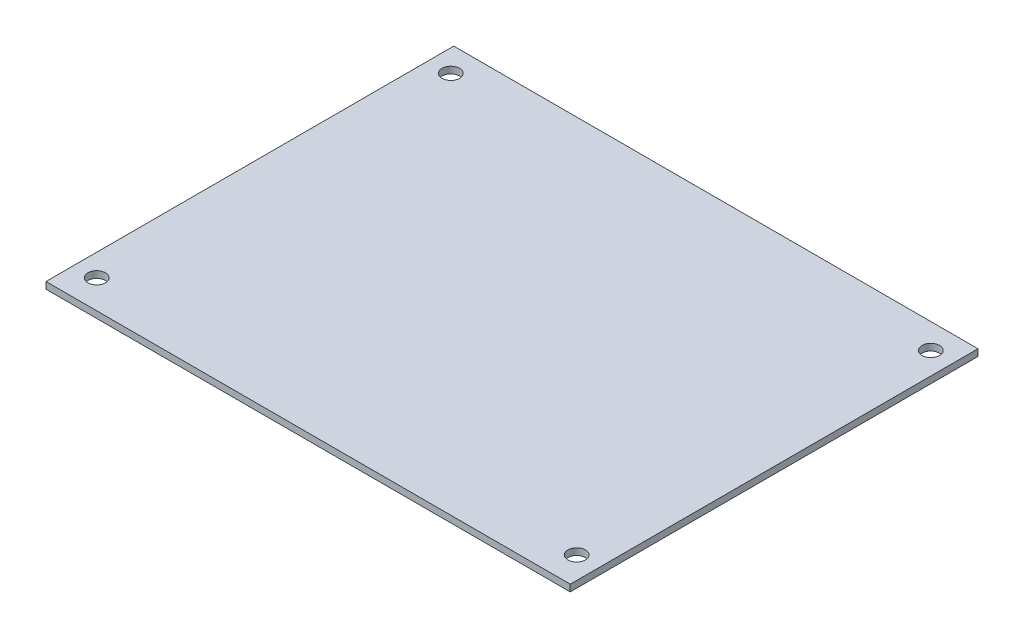
ISO-10303-21;
HEADER;
FILE_DESCRIPTION(('STEP AP214'),'2;1');
FILE_NAME('part.step','',(''),(''),'','','');
FILE_SCHEMA(('AUTOMOTIVE_DESIGN { 1 0 10303 214 1 1 1 1 }'));
ENDSEC;
DATA;
#1=APPLICATION_CONTEXT('core data for automotive mechanical design processes');
#2=APPLICATION_PROTOCOL_DEFINITION('international standard','automotive_design',2000,#1);
#3=PRODUCT_CONTEXT('',#1,'mechanical');
#4=PRODUCT('Part','Part','',(#3));
#5=PRODUCT_RELATED_PRODUCT_CATEGORY('part','',(#4));
#6=PRODUCT_DEFINITION_FORMATION('','',#4);
#7=PRODUCT_DEFINITION_CONTEXT('part definition',#1,'design');
#8=PRODUCT_DEFINITION('design','',#6,#7);
#9=PRODUCT_DEFINITION_SHAPE('','',#8);
#10=(LENGTH_UNIT() NAMED_UNIT(*) SI_UNIT(.MILLI.,.METRE.));
#11=(NAMED_UNIT(*) PLANE_ANGLE_UNIT() SI_UNIT($,.RADIAN.));
#12=(NAMED_UNIT(*) SI_UNIT($,.STERADIAN.) SOLID_ANGLE_UNIT());
#13=UNCERTAINTY_MEASURE_WITH_UNIT(LENGTH_MEASURE(1.E-05),#10,'distance_accuracy_value','');
#14=(GEOMETRIC_REPRESENTATION_CONTEXT(3) GLOBAL_UNCERTAINTY_ASSIGNED_CONTEXT((#13)) GLOBAL_UNIT_ASSIGNED_CONTEXT((#10,
#11,#12)) REPRESENTATION_CONTEXT('',''));
#15=CARTESIAN_POINT('',(0.,0.,0.));
#16=DIRECTION('',(0.,0.,1.));
#17=DIRECTION('',(1.,0.,0.));
#18=AXIS2_PLACEMENT_3D('',#15,#16,#17);
#19=CARTESIAN_POINT('',(45.,1.15,-35.));
#20=DIRECTION('',(-1.,0.,0.));
#21=DIRECTION('',(0.,0.,1.));
#22=AXIS2_PLACEMENT_3D('',#19,#20,#21);
#23=PLANE('',#22);
#24=DIRECTION('',(0.,0.,-1.));
#25=VECTOR('',#24,1.);
#26=CARTESIAN_POINT('',(45.,0.,-35.));
#27=LINE('',#26,#25);
#28=CARTESIAN_POINT('',(45.,0.,35.));
#29=VERTEX_POINT('',#28);
#30=CARTESIAN_POINT('',(45.,0.,-35.));
#31=VERTEX_POINT('',#30);
#32=EDGE_CURVE('E97',#29,#31,#27,.T.);
#33=ORIENTED_EDGE('',*,*,#32,.T.);
#34=DIRECTION('',(0.,-1.,0.));
#35=VECTOR('',#34,1.);
#36=CARTESIAN_POINT('',(45.,1.15,-35.));
#37=LINE('',#36,#35);
#38=CARTESIAN_POINT('',(45.,1.15,-35.));
#39=VERTEX_POINT('',#38);
#40=EDGE_CURVE('E11',#39,#31,#37,.T.);
#41=ORIENTED_EDGE('',*,*,#40,.F.);
#42=DIRECTION('',(0.,0.,-1.));
#43=VECTOR('',#42,1.);
#44=CARTESIAN_POINT('',(45.,1.15,-35.));
#45=LINE('',#44,#43);
#46=CARTESIAN_POINT('',(45.,1.15,35.));
#47=VERTEX_POINT('',#46);
#48=EDGE_CURVE('E85',#47,#39,#45,.T.);
#49=ORIENTED_EDGE('',*,*,#48,.F.);
#50=DIRECTION('',(0.,-1.,0.));
#51=VECTOR('',#50,1.);
#52=CARTESIAN_POINT('',(45.,1.15,35.));
#53=LINE('',#52,#51);
#54=EDGE_CURVE('E93',#47,#29,#53,.T.);
#55=ORIENTED_EDGE('',*,*,#54,.T.);
#56=EDGE_LOOP('',(#33,#41,#49,#55));
#57=FACE_BOUND('',#56,.T.);
#58=ADVANCED_FACE('F34',(#57),#23,.F.);
#59=CARTESIAN_POINT('',(-45.,1.15,-35.));
#60=DIRECTION('',(0.,0.,1.));
#61=DIRECTION('',(1.,0.,0.));
#62=AXIS2_PLACEMENT_3D('',#59,#60,#61);
#63=PLANE('',#62);
#64=DIRECTION('',(-1.,0.,0.));
#65=VECTOR('',#64,1.);
#66=CARTESIAN_POINT('',(-45.,0.,-35.));
#67=LINE('',#66,#65);
#68=CARTESIAN_POINT('',(-45.,0.,-35.));
#69=VERTEX_POINT('',#68);
#70=EDGE_CURVE('E89',#31,#69,#67,.T.);
#71=ORIENTED_EDGE('',*,*,#70,.T.);
#72=DIRECTION('',(0.,-1.,0.));
#73=VECTOR('',#72,1.);
#74=CARTESIAN_POINT('',(-45.,1.15,-35.));
#75=LINE('',#74,#73);
#76=CARTESIAN_POINT('',(-45.,1.15,-35.));
#77=VERTEX_POINT('',#76);
#78=EDGE_CURVE('E42',#77,#69,#75,.T.);
#79=ORIENTED_EDGE('',*,*,#78,.F.);
#80=DIRECTION('',(-1.,0.,0.));
#81=VECTOR('',#80,1.);
#82=CARTESIAN_POINT('',(-45.,1.15,-35.));
#83=LINE('',#82,#81);
#84=EDGE_CURVE('E80',#39,#77,#83,.T.);
#85=ORIENTED_EDGE('',*,*,#84,.F.);
#86=ORIENTED_EDGE('',*,*,#40,.T.);
#87=EDGE_LOOP('',(#71,#79,#85,#86));
#88=FACE_BOUND('',#87,.T.);
#89=ADVANCED_FACE('F88',(#88),#63,.F.);
#90=CARTESIAN_POINT('',(-45.,1.15,-35.));
#91=DIRECTION('',(1.,0.,0.));
#92=DIRECTION('',(0.,0.,-1.));
#93=AXIS2_PLACEMENT_3D('',#90,#91,#92);
#94=PLANE('',#93);
#95=DIRECTION('',(0.,0.,1.));
#96=VECTOR('',#95,1.);
#97=CARTESIAN_POINT('',(-45.,0.,-35.));
#98=LINE('',#97,#96);
#99=CARTESIAN_POINT('',(-45.,0.,35.));
#100=VERTEX_POINT('',#99);
#101=EDGE_CURVE('E67',#69,#100,#98,.T.);
#102=ORIENTED_EDGE('',*,*,#101,.T.);
#103=DIRECTION('',(0.,-1.,0.));
#104=VECTOR('',#103,1.);
#105=CARTESIAN_POINT('',(-45.,1.15,35.));
#106=LINE('',#105,#104);
#107=CARTESIAN_POINT('',(-45.,1.15,35.));
#108=VERTEX_POINT('',#107);
#109=EDGE_CURVE('E90',#108,#100,#106,.T.);
#110=ORIENTED_EDGE('',*,*,#109,.F.);
#111=DIRECTION('',(0.,0.,1.));
#112=VECTOR('',#111,1.);
#113=CARTESIAN_POINT('',(-45.,1.15,-35.));
#114=LINE('',#113,#112);
#115=EDGE_CURVE('E83',#77,#108,#114,.T.);
#116=ORIENTED_EDGE('',*,*,#115,.F.);
#117=ORIENTED_EDGE('',*,*,#78,.T.);
#118=EDGE_LOOP('',(#102,#110,#116,#117));
#119=FACE_BOUND('',#118,.T.);
#120=ADVANCED_FACE('F91',(#119),#94,.F.);
#121=CARTESIAN_POINT('',(-45.,1.15,35.));
#122=DIRECTION('',(0.,0.,-1.));
#123=DIRECTION('',(-1.,0.,0.));
#124=AXIS2_PLACEMENT_3D('',#121,#122,#123);
#125=PLANE('',#124);
#126=DIRECTION('',(1.,0.,0.));
#127=VECTOR('',#126,1.);
#128=CARTESIAN_POINT('',(-45.,0.,35.));
#129=LINE('',#128,#127);
#130=EDGE_CURVE('E73',#100,#29,#129,.T.);
#131=ORIENTED_EDGE('',*,*,#130,.T.);
#132=ORIENTED_EDGE('',*,*,#54,.F.);
#133=DIRECTION('',(1.,0.,0.));
#134=VECTOR('',#133,1.);
#135=CARTESIAN_POINT('',(-45.,1.15,35.));
#136=LINE('',#135,#134);
#137=EDGE_CURVE('E50',#108,#47,#136,.T.);
#138=ORIENTED_EDGE('',*,*,#137,.F.);
#139=ORIENTED_EDGE('',*,*,#109,.T.);
#140=EDGE_LOOP('',(#131,#132,#138,#139));
#141=FACE_BOUND('',#140,.T.);
#142=ADVANCED_FACE('F105',(#141),#125,.F.);
#143=CARTESIAN_POINT('',(0.,1.15,0.));
#144=DIRECTION('',(0.,1.,0.));
#145=DIRECTION('',(0.,0.,1.));
#146=AXIS2_PLACEMENT_3D('',#143,#144,#145);
#147=PLANE('',#146);
#148=CARTESIAN_POINT('',(-41.2,1.15,-30.7));
#149=DIRECTION('',(0.,1.,0.));
#150=DIRECTION('',(0.,0.,-1.));
#151=AXIS2_PLACEMENT_3D('',#148,#149,#150);
#152=CIRCLE('',#151,1.5);
#153=CARTESIAN_POINT('',(-41.2,1.15,-32.2));
#154=VERTEX_POINT('',#153);
#155=EDGE_CURVE('E117',#154,#154,#152,.T.);
#156=ORIENTED_EDGE('',*,*,#155,.F.);
#157=EDGE_LOOP('',(#156));
#158=FACE_BOUND('',#157,.T.);
#159=CARTESIAN_POINT('',(-41.2,1.15,30.1));
#160=DIRECTION('',(0.,1.,0.));
#161=DIRECTION('',(0.,0.,-1.));
#162=AXIS2_PLACEMENT_3D('',#159,#160,#161);
#163=CIRCLE('',#162,1.5);
#164=CARTESIAN_POINT('',(-41.2,1.15,28.6));
#165=VERTEX_POINT('',#164);
#166=EDGE_CURVE('E123',#165,#165,#163,.T.);
#167=ORIENTED_EDGE('',*,*,#166,.F.);
#168=EDGE_LOOP('',(#167));
#169=FACE_BOUND('',#168,.T.);
#170=CARTESIAN_POINT('',(41.2,1.15,30.1));
#171=DIRECTION('',(0.,1.,0.));
#172=DIRECTION('',(0.,0.,1.));
#173=AXIS2_PLACEMENT_3D('',#170,#171,#172);
#174=CIRCLE('',#173,1.5);
#175=CARTESIAN_POINT('',(41.2,1.15,31.6));
#176=VERTEX_POINT('',#175);
#177=EDGE_CURVE('E129',#176,#176,#174,.T.);
#178=ORIENTED_EDGE('',*,*,#177,.F.);
#179=EDGE_LOOP('',(#178));
#180=FACE_BOUND('',#179,.T.);
#181=CARTESIAN_POINT('',(41.2,1.15,-30.7));
#182=DIRECTION('',(0.,1.,0.));
#183=DIRECTION('',(0.,0.,1.));
#184=AXIS2_PLACEMENT_3D('',#181,#182,#183);
#185=CIRCLE('',#184,1.5);
#186=CARTESIAN_POINT('',(41.2,1.15,-29.2));
#187=VERTEX_POINT('',#186);
#188=EDGE_CURVE('E111',#187,#187,#185,.T.);
#189=ORIENTED_EDGE('',*,*,#188,.F.);
#190=EDGE_LOOP('',(#189));
#191=FACE_BOUND('',#190,.T.);
#192=ORIENTED_EDGE('',*,*,#48,.T.);
#193=ORIENTED_EDGE('',*,*,#84,.T.);
#194=ORIENTED_EDGE('',*,*,#115,.T.);
#195=ORIENTED_EDGE('',*,*,#137,.T.);
#196=EDGE_LOOP('',(#192,#193,#194,#195));
#197=FACE_BOUND('',#196,.T.);
#198=ADVANCED_FACE('F81',(#158,#169,#180,#191,#197),#147,.T.);
#199=CARTESIAN_POINT('',(0.,0.,0.));
#200=DIRECTION('',(0.,1.,0.));
#201=DIRECTION('',(0.,0.,1.));
#202=AXIS2_PLACEMENT_3D('',#199,#200,#201);
#203=PLANE('',#202);
#204=CARTESIAN_POINT('',(-41.2,0.,-30.7));
#205=DIRECTION('',(0.,1.,0.));
#206=DIRECTION('',(0.,0.,-1.));
#207=AXIS2_PLACEMENT_3D('',#204,#205,#206);
#208=CIRCLE('',#207,1.5);
#209=CARTESIAN_POINT('',(-41.2,0.,-32.2));
#210=VERTEX_POINT('',#209);
#211=EDGE_CURVE('E120',#210,#210,#208,.T.);
#212=ORIENTED_EDGE('',*,*,#211,.T.);
#213=EDGE_LOOP('',(#212));
#214=FACE_BOUND('',#213,.T.);
#215=CARTESIAN_POINT('',(-41.2,0.,30.1));
#216=DIRECTION('',(0.,1.,0.));
#217=DIRECTION('',(0.,0.,-1.));
#218=AXIS2_PLACEMENT_3D('',#215,#216,#217);
#219=CIRCLE('',#218,1.5);
#220=CARTESIAN_POINT('',(-41.2,0.,28.6));
#221=VERTEX_POINT('',#220);
#222=EDGE_CURVE('E126',#221,#221,#219,.T.);
#223=ORIENTED_EDGE('',*,*,#222,.T.);
#224=EDGE_LOOP('',(#223));
#225=FACE_BOUND('',#224,.T.);
#226=CARTESIAN_POINT('',(41.2,0.,30.1));
#227=DIRECTION('',(0.,1.,0.));
#228=DIRECTION('',(0.,0.,1.));
#229=AXIS2_PLACEMENT_3D('',#226,#227,#228);
#230=CIRCLE('',#229,1.5);
#231=CARTESIAN_POINT('',(41.2,0.,31.6));
#232=VERTEX_POINT('',#231);
#233=EDGE_CURVE('E114',#232,#232,#230,.T.);
#234=ORIENTED_EDGE('',*,*,#233,.T.);
#235=EDGE_LOOP('',(#234));
#236=FACE_BOUND('',#235,.T.);
#237=CARTESIAN_POINT('',(41.2,0.,-30.7));
#238=DIRECTION('',(0.,1.,0.));
#239=DIRECTION('',(0.,0.,1.));
#240=AXIS2_PLACEMENT_3D('',#237,#238,#239);
#241=CIRCLE('',#240,1.5);
#242=CARTESIAN_POINT('',(41.2,0.,-29.2));
#243=VERTEX_POINT('',#242);
#244=EDGE_CURVE('E100',#243,#243,#241,.T.);
#245=ORIENTED_EDGE('',*,*,#244,.T.);
#246=EDGE_LOOP('',(#245));
#247=FACE_BOUND('',#246,.T.);
#248=ORIENTED_EDGE('',*,*,#32,.F.);
#249=ORIENTED_EDGE('',*,*,#130,.F.);
#250=ORIENTED_EDGE('',*,*,#101,.F.);
#251=ORIENTED_EDGE('',*,*,#70,.F.);
#252=EDGE_LOOP('',(#248,#249,#250,#251));
#253=FACE_BOUND('',#252,.T.);
#254=ADVANCED_FACE('F108',(#214,#225,#236,#247,#253),#203,.F.);
#255=CARTESIAN_POINT('',(41.2,0.,-30.7));
#256=DIRECTION('',(0.,1.,0.));
#257=DIRECTION('',(0.,0.,1.));
#258=AXIS2_PLACEMENT_3D('',#255,#256,#257);
#259=CYLINDRICAL_SURFACE('',#258,1.5);
#260=ORIENTED_EDGE('',*,*,#244,.F.);
#261=EDGE_LOOP('',(#260));
#262=FACE_BOUND('',#261,.T.);
#263=ORIENTED_EDGE('',*,*,#188,.T.);
#264=EDGE_LOOP('',(#263));
#265=FACE_BOUND('',#264,.T.);
#266=ADVANCED_FACE('F141',(#262,#265),#259,.F.);
#267=CARTESIAN_POINT('',(41.2,0.,30.1));
#268=DIRECTION('',(0.,1.,0.));
#269=DIRECTION('',(0.,0.,1.));
#270=AXIS2_PLACEMENT_3D('',#267,#268,#269);
#271=CYLINDRICAL_SURFACE('',#270,1.5);
#272=ORIENTED_EDGE('',*,*,#233,.F.);
#273=EDGE_LOOP('',(#272));
#274=FACE_BOUND('',#273,.T.);
#275=ORIENTED_EDGE('',*,*,#177,.T.);
#276=EDGE_LOOP('',(#275));
#277=FACE_BOUND('',#276,.T.);
#278=ADVANCED_FACE('F137',(#274,#277),#271,.F.);
#279=CARTESIAN_POINT('',(-41.2,0.,30.1));
#280=DIRECTION('',(0.,1.,0.));
#281=DIRECTION('',(0.,0.,1.));
#282=AXIS2_PLACEMENT_3D('',#279,#280,#281);
#283=CYLINDRICAL_SURFACE('',#282,1.5);
#284=ORIENTED_EDGE('',*,*,#222,.F.);
#285=EDGE_LOOP('',(#284));
#286=FACE_BOUND('',#285,.T.);
#287=ORIENTED_EDGE('',*,*,#166,.T.);
#288=EDGE_LOOP('',(#287));
#289=FACE_BOUND('',#288,.T.);
#290=ADVANCED_FACE('F140',(#286,#289),#283,.F.);
#291=CARTESIAN_POINT('',(-41.2,0.,-30.7));
#292=DIRECTION('',(0.,1.,0.));
#293=DIRECTION('',(0.,0.,1.));
#294=AXIS2_PLACEMENT_3D('',#291,#292,#293);
#295=CYLINDRICAL_SURFACE('',#294,1.5);
#296=ORIENTED_EDGE('',*,*,#211,.F.);
#297=EDGE_LOOP('',(#296));
#298=FACE_BOUND('',#297,.T.);
#299=ORIENTED_EDGE('',*,*,#155,.T.);
#300=EDGE_LOOP('',(#299));
#301=FACE_BOUND('',#300,.T.);
#302=ADVANCED_FACE('F202',(#298,#301),#295,.F.);
#303=CLOSED_SHELL('',(#58,#89,#120,#142,#198,#254,#266,#278,#290,#302));
#304=MANIFOLD_SOLID_BREP('B2',#303);
#305=ADVANCED_BREP_SHAPE_REPRESENTATION('',(#18,#304),#14);
#306=SHAPE_DEFINITION_REPRESENTATION(#9,#305);
ENDSEC;
END-ISO-10303-21;
